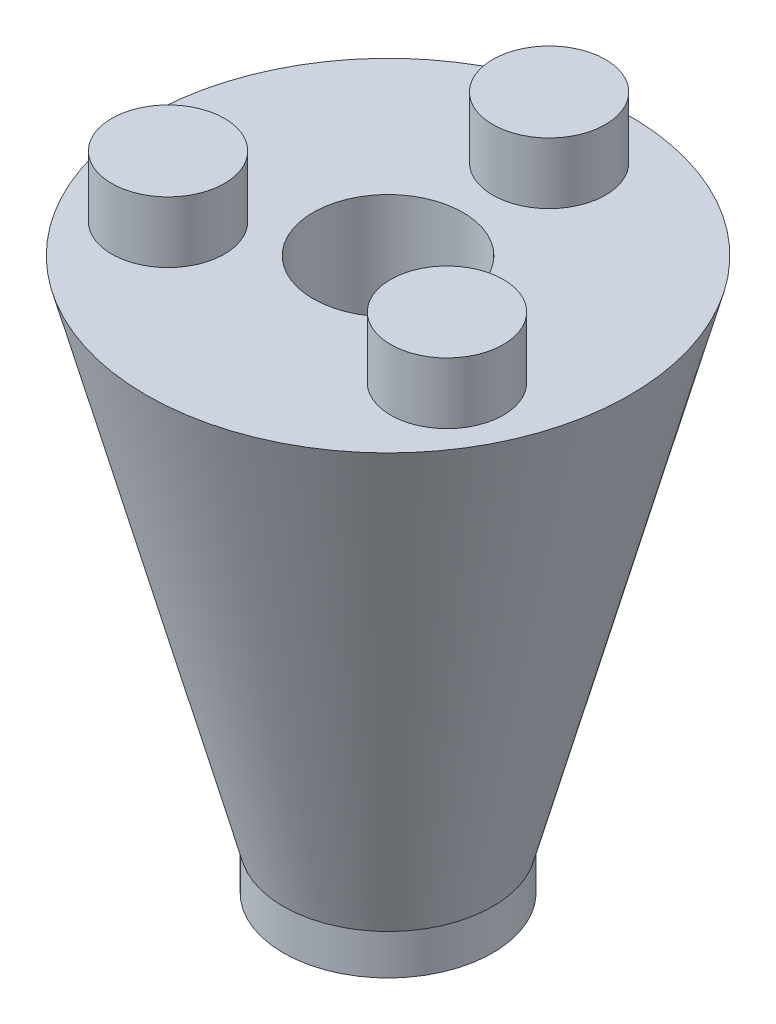
ISO-10303-21;
HEADER;
FILE_DESCRIPTION(('STEP AP214'),'2;1');
FILE_NAME('part.step','',(''),(''),'','','');
FILE_SCHEMA(('AUTOMOTIVE_DESIGN { 1 0 10303 214 1 1 1 1 }'));
ENDSEC;
DATA;
#1=APPLICATION_CONTEXT('core data for automotive mechanical design processes');
#2=APPLICATION_PROTOCOL_DEFINITION('international standard','automotive_design',2000,#1);
#3=PRODUCT_CONTEXT('',#1,'mechanical');
#4=PRODUCT('Part','Part','',(#3));
#5=PRODUCT_RELATED_PRODUCT_CATEGORY('part','',(#4));
#6=PRODUCT_DEFINITION_FORMATION('','',#4);
#7=PRODUCT_DEFINITION_CONTEXT('part definition',#1,'design');
#8=PRODUCT_DEFINITION('design','',#6,#7);
#9=PRODUCT_DEFINITION_SHAPE('','',#8);
#10=(LENGTH_UNIT() NAMED_UNIT(*) SI_UNIT(.MILLI.,.METRE.));
#11=(NAMED_UNIT(*) PLANE_ANGLE_UNIT() SI_UNIT($,.RADIAN.));
#12=(NAMED_UNIT(*) SI_UNIT($,.STERADIAN.) SOLID_ANGLE_UNIT());
#13=UNCERTAINTY_MEASURE_WITH_UNIT(LENGTH_MEASURE(1.E-05),#10,'distance_accuracy_value','');
#14=(GEOMETRIC_REPRESENTATION_CONTEXT(3) GLOBAL_UNCERTAINTY_ASSIGNED_CONTEXT((#13)) GLOBAL_UNIT_ASSIGNED_CONTEXT((#10,
#11,#12)) REPRESENTATION_CONTEXT('',''));
#15=CARTESIAN_POINT('',(0.,0.,0.));
#16=DIRECTION('',(0.,0.,1.));
#17=DIRECTION('',(1.,0.,0.));
#18=AXIS2_PLACEMENT_3D('',#15,#16,#17);
#19=CARTESIAN_POINT('',(0.,31.75,0.));
#20=DIRECTION('',(0.,1.,0.));
#21=DIRECTION('',(0.,0.,1.));
#22=AXIS2_PLACEMENT_3D('',#19,#20,#21);
#23=PLANE('',#22);
#24=CARTESIAN_POINT('',(-8.66025409500206,31.75,5.000000033));
#25=DIRECTION('',(0.,1.,0.));
#26=DIRECTION('',(0.,0.,1.));
#27=AXIS2_PLACEMENT_3D('',#24,#25,#26);
#28=CIRCLE('',#27,3.499999985);
#29=CARTESIAN_POINT('',(-8.66025409500206,31.75,1.500000048));
#30=VERTEX_POINT('',#29);
#31=EDGE_CURVE('E56',#30,#30,#28,.T.);
#32=ORIENTED_EDGE('',*,*,#31,.F.);
#33=EDGE_LOOP('',(#32));
#34=FACE_BOUND('',#33,.T.);
#35=CARTESIAN_POINT('',(0.,31.75,0.));
#36=DIRECTION('',(0.,1.,0.));
#37=DIRECTION('',(0.,0.,1.));
#38=AXIS2_PLACEMENT_3D('',#35,#36,#37);
#39=CIRCLE('',#38,15.0073869406882);
#40=CARTESIAN_POINT('',(0.,31.75,15.0073869406882));
#41=VERTEX_POINT('',#40);
#42=EDGE_CURVE('E10',#41,#41,#39,.T.);
#43=ORIENTED_EDGE('',*,*,#42,.T.);
#44=EDGE_LOOP('',(#43));
#45=FACE_BOUND('',#44,.T.);
#46=CARTESIAN_POINT('',(0.,31.75,0.));
#47=DIRECTION('',(0.,1.,0.));
#48=DIRECTION('',(0.,0.,1.));
#49=AXIS2_PLACEMENT_3D('',#46,#47,#48);
#50=CIRCLE('',#49,4.649999971);
#51=CARTESIAN_POINT('',(0.,31.75,4.649999971));
#52=VERTEX_POINT('',#51);
#53=EDGE_CURVE('E43',#52,#52,#50,.T.);
#54=ORIENTED_EDGE('',*,*,#53,.F.);
#55=EDGE_LOOP('',(#54));
#56=FACE_BOUND('',#55,.T.);
#57=CARTESIAN_POINT('',(0.,31.75,-10.000000066));
#58=DIRECTION('',(0.,1.,0.));
#59=DIRECTION('',(0.,0.,1.));
#60=AXIS2_PLACEMENT_3D('',#57,#58,#59);
#61=CIRCLE('',#60,3.499999985);
#62=CARTESIAN_POINT('',(0.,31.75,-13.500000051));
#63=VERTEX_POINT('',#62);
#64=EDGE_CURVE('E50',#63,#63,#61,.T.);
#65=ORIENTED_EDGE('',*,*,#64,.F.);
#66=EDGE_LOOP('',(#65));
#67=FACE_BOUND('',#66,.T.);
#68=CARTESIAN_POINT('',(8.66025409500207,31.75,5.000000033));
#69=DIRECTION('',(0.,1.,0.));
#70=DIRECTION('',(0.,0.,1.));
#71=AXIS2_PLACEMENT_3D('',#68,#69,#70);
#72=CIRCLE('',#71,3.499999985);
#73=CARTESIAN_POINT('',(8.66025409500207,31.75,1.500000048));
#74=VERTEX_POINT('',#73);
#75=EDGE_CURVE('E62',#74,#74,#72,.T.);
#76=ORIENTED_EDGE('',*,*,#75,.F.);
#77=EDGE_LOOP('',(#76));
#78=FACE_BOUND('',#77,.T.);
#79=ADVANCED_FACE('F32',(#34,#45,#56,#67,#78),#23,.T.);
#80=CARTESIAN_POINT('',(0.,0.,0.));
#81=DIRECTION('',(0.,1.,0.));
#82=DIRECTION('',(0.,0.,1.));
#83=AXIS2_PLACEMENT_3D('',#80,#81,#82);
#84=CONICAL_SURFACE('',#83,6.500000081,0.26179938779915);
#85=ORIENTED_EDGE('',*,*,#42,.F.);
#86=EDGE_LOOP('',(#85));
#87=FACE_BOUND('',#86,.T.);
#88=CARTESIAN_POINT('',(0.,0.,0.));
#89=DIRECTION('',(0.,-1.,0.));
#90=DIRECTION('',(0.,0.,-1.));
#91=AXIS2_PLACEMENT_3D('',#88,#89,#90);
#92=CIRCLE('',#91,6.500000081);
#93=CARTESIAN_POINT('',(0.,0.,-6.500000081));
#94=VERTEX_POINT('',#93);
#95=EDGE_CURVE('E68',#94,#94,#92,.T.);
#96=ORIENTED_EDGE('',*,*,#95,.F.);
#97=EDGE_LOOP('',(#96));
#98=FACE_BOUND('',#97,.T.);
#99=ADVANCED_FACE('F34',(#87,#98),#84,.T.);
#100=CARTESIAN_POINT('',(0.,0.,0.));
#101=DIRECTION('',(0.,1.,0.));
#102=DIRECTION('',(0.,0.,1.));
#103=AXIS2_PLACEMENT_3D('',#100,#101,#102);
#104=CYLINDRICAL_SURFACE('',#103,4.649999971);
#105=CARTESIAN_POINT('',(0.,0.,0.));
#106=DIRECTION('',(0.,1.,0.));
#107=DIRECTION('',(0.,0.,1.));
#108=AXIS2_PLACEMENT_3D('',#105,#106,#107);
#109=CIRCLE('',#108,4.649999971);
#110=CARTESIAN_POINT('',(0.,0.,4.649999971));
#111=VERTEX_POINT('',#110);
#112=EDGE_CURVE('E39',#111,#111,#109,.T.);
#113=ORIENTED_EDGE('',*,*,#112,.F.);
#114=EDGE_LOOP('',(#113));
#115=FACE_BOUND('',#114,.T.);
#116=ORIENTED_EDGE('',*,*,#53,.T.);
#117=EDGE_LOOP('',(#116));
#118=FACE_BOUND('',#117,.T.);
#119=ADVANCED_FACE('F104',(#115,#118),#104,.F.);
#120=CARTESIAN_POINT('',(0.,35.55000002,-10.000000066));
#121=DIRECTION('',(0.,-1.,0.));
#122=DIRECTION('',(0.,0.,-1.));
#123=AXIS2_PLACEMENT_3D('',#120,#121,#122);
#124=CYLINDRICAL_SURFACE('',#123,3.499999985);
#125=CARTESIAN_POINT('',(0.,35.55000002,-10.000000066));
#126=DIRECTION('',(0.,1.,0.));
#127=DIRECTION('',(0.,0.,1.));
#128=AXIS2_PLACEMENT_3D('',#125,#126,#127);
#129=CIRCLE('',#128,3.499999985);
#130=CARTESIAN_POINT('',(0.,35.55000002,-13.500000051));
#131=VERTEX_POINT('',#130);
#132=EDGE_CURVE('E48',#131,#131,#129,.T.);
#133=CARTESIAN_POINT('',(0.,35.55000002,-13.500000051));
#134=CARTESIAN_POINT('',(0.,35.5104166864583,-13.500000051));
#135=CARTESIAN_POINT('',(0.,35.4708333529167,-13.500000051));
#136=CARTESIAN_POINT('',(0.,35.3916666858333,-13.500000051));
#137=CARTESIAN_POINT('',(0.,35.3520833522917,-13.500000051));
#138=CARTESIAN_POINT('',(0.,35.2729166852083,-13.500000051));
#139=CARTESIAN_POINT('',(0.,35.2333333516667,-13.500000051));
#140=CARTESIAN_POINT('',(0.,35.1541666845833,-13.500000051));
#141=CARTESIAN_POINT('',(0.,35.1145833510417,-13.500000051));
#142=CARTESIAN_POINT('',(0.,35.0354166839583,-13.500000051));
#143=CARTESIAN_POINT('',(0.,34.9958333504167,-13.500000051));
#144=CARTESIAN_POINT('',(0.,34.9166666833333,-13.500000051));
#145=CARTESIAN_POINT('',(0.,34.8770833497917,-13.500000051));
#146=CARTESIAN_POINT('',(0.,34.7979166827083,-13.500000051));
#147=CARTESIAN_POINT('',(0.,34.7583333491667,-13.500000051));
#148=CARTESIAN_POINT('',(0.,34.6791666820833,-13.500000051));
#149=CARTESIAN_POINT('',(0.,34.6395833485417,-13.500000051));
#150=CARTESIAN_POINT('',(0.,34.5604166814583,-13.500000051));
#151=CARTESIAN_POINT('',(0.,34.5208333479167,-13.500000051));
#152=CARTESIAN_POINT('',(0.,34.4416666808333,-13.500000051));
#153=CARTESIAN_POINT('',(0.,34.4020833472917,-13.500000051));
#154=CARTESIAN_POINT('',(0.,34.3229166802083,-13.500000051));
#155=CARTESIAN_POINT('',(0.,34.2833333466667,-13.500000051));
#156=CARTESIAN_POINT('',(0.,34.2041666795833,-13.500000051));
#157=CARTESIAN_POINT('',(0.,34.1645833460417,-13.500000051));
#158=CARTESIAN_POINT('',(0.,34.0854166789583,-13.500000051));
#159=CARTESIAN_POINT('',(0.,34.0458333454167,-13.500000051));
#160=CARTESIAN_POINT('',(0.,33.9666666783333,-13.500000051));
#161=CARTESIAN_POINT('',(0.,33.9270833447917,-13.500000051));
#162=CARTESIAN_POINT('',(0.,33.8479166777083,-13.500000051));
#163=CARTESIAN_POINT('',(0.,33.8083333441667,-13.500000051));
#164=CARTESIAN_POINT('',(0.,33.7291666770833,-13.500000051));
#165=CARTESIAN_POINT('',(0.,33.6895833435417,-13.500000051));
#166=CARTESIAN_POINT('',(0.,33.6104166764583,-13.500000051));
#167=CARTESIAN_POINT('',(0.,33.5708333429167,-13.500000051));
#168=CARTESIAN_POINT('',(0.,33.4916666758333,-13.500000051));
#169=CARTESIAN_POINT('',(0.,33.4520833422917,-13.500000051));
#170=CARTESIAN_POINT('',(0.,33.3729166752083,-13.500000051));
#171=CARTESIAN_POINT('',(0.,33.3333333416667,-13.500000051));
#172=CARTESIAN_POINT('',(0.,33.2541666745833,-13.500000051));
#173=CARTESIAN_POINT('',(0.,33.2145833410417,-13.500000051));
#174=CARTESIAN_POINT('',(0.,33.1354166739583,-13.500000051));
#175=CARTESIAN_POINT('',(0.,33.0958333404167,-13.500000051));
#176=CARTESIAN_POINT('',(0.,33.0166666733333,-13.500000051));
#177=CARTESIAN_POINT('',(0.,32.9770833397917,-13.500000051));
#178=CARTESIAN_POINT('',(0.,32.8979166727083,-13.500000051));
#179=CARTESIAN_POINT('',(0.,32.8583333391667,-13.500000051));
#180=CARTESIAN_POINT('',(0.,32.7791666720833,-13.500000051));
#181=CARTESIAN_POINT('',(0.,32.7395833385417,-13.500000051));
#182=CARTESIAN_POINT('',(0.,32.6604166714583,-13.500000051));
#183=CARTESIAN_POINT('',(0.,32.6208333379167,-13.500000051));
#184=CARTESIAN_POINT('',(0.,32.5416666708333,-13.500000051));
#185=CARTESIAN_POINT('',(0.,32.5020833372917,-13.500000051));
#186=CARTESIAN_POINT('',(0.,32.4229166702083,-13.500000051));
#187=CARTESIAN_POINT('',(0.,32.3833333366667,-13.500000051));
#188=CARTESIAN_POINT('',(0.,32.3041666695833,-13.500000051));
#189=CARTESIAN_POINT('',(0.,32.2645833360417,-13.500000051));
#190=CARTESIAN_POINT('',(0.,32.1854166689583,-13.500000051));
#191=CARTESIAN_POINT('',(0.,32.1458333354167,-13.500000051));
#192=CARTESIAN_POINT('',(0.,32.0666666683333,-13.500000051));
#193=CARTESIAN_POINT('',(0.,32.0270833347917,-13.500000051));
#194=CARTESIAN_POINT('',(0.,31.9479166677083,-13.500000051));
#195=CARTESIAN_POINT('',(0.,31.9083333341667,-13.500000051));
#196=CARTESIAN_POINT('',(0.,31.8291666670833,-13.500000051));
#197=CARTESIAN_POINT('',(0.,31.7895833335417,-13.500000051));
#198=CARTESIAN_POINT('',(0.,31.75,-13.500000051));
#199=B_SPLINE_CURVE_WITH_KNOTS('',3,(#133,#134,#135,#136,#137,#138,#139,#140,#141,#142,#143,
#144,#145,#146,#147,#148,#149,#150,#151,#152,#153,#154,#155,#156,#157,#158,#159,#160,#161,#162,
#163,#164,#165,#166,#167,#168,#169,#170,#171,#172,#173,#174,#175,#176,#177,#178,#179,#180,#181,
#182,#183,#184,#185,#186,#187,#188,#189,#190,#191,#192,#193,#194,#195,#196,#197,#198),
.UNSPECIFIED.,.F.,.F.,(4,2,2,2,2,2,2,2,2,2,2,2,2,2,2,2,2,2,2,2,2,2,2,2,2,2,2,2,2,2,2,2,4),(0.,
0.118750000624994,0.237500001249995,0.356250001874996,0.475000002499996,0.593750003124997,
0.712500003749998,0.831250004374999,0.950000005,1.06875000562499,1.18750000624999,
1.306250006875,1.4250000075,1.543750008125,1.66250000875,1.781250009375,1.90000001,
2.01875001062499,2.13750001124999,2.256250011875,2.3750000125,2.493750013125,2.61250001375,
2.731250014375,2.850000015,2.96875001562499,3.08750001624999,3.206250016875,3.3250000175,
3.443750018125,3.56250001875,3.681250019375,3.80000002),.UNSPECIFIED.);
#200=EDGE_CURVE('BSEAM110',#131,#63,#199,.T.);
#201=ORIENTED_EDGE('',*,*,#132,.F.);
#202=ORIENTED_EDGE('',*,*,#64,.T.);
#203=ORIENTED_EDGE('',*,*,#200,.T.);
#204=ORIENTED_EDGE('',*,*,#200,.F.);
#205=EDGE_LOOP('',(#201,#203,#202,#204));
#206=FACE_BOUND('',#205,.T.);
#207=ADVANCED_FACE('F110',(#206),#124,.T.);
#208=CARTESIAN_POINT('',(0.,35.55000002,0.));
#209=DIRECTION('',(0.,1.,0.));
#210=DIRECTION('',(0.,0.,1.));
#211=AXIS2_PLACEMENT_3D('',#208,#209,#210);
#212=PLANE('',#211);
#213=ORIENTED_EDGE('',*,*,#132,.T.);
#214=EDGE_LOOP('',(#213));
#215=FACE_BOUND('',#214,.T.);
#216=ADVANCED_FACE('F114',(#215),#212,.T.);
#217=CARTESIAN_POINT('',(-8.66025409500206,35.55000002,5.000000033));
#218=DIRECTION('',(0.,-1.,0.));
#219=DIRECTION('',(0.,0.,-1.));
#220=AXIS2_PLACEMENT_3D('',#217,#218,#219);
#221=CYLINDRICAL_SURFACE('',#220,3.499999985);
#222=CARTESIAN_POINT('',(-8.66025409500206,35.55000002,5.000000033));
#223=DIRECTION('',(0.,1.,0.));
#224=DIRECTION('',(0.,0.,1.));
#225=AXIS2_PLACEMENT_3D('',#222,#223,#224);
#226=CIRCLE('',#225,3.499999985);
#227=CARTESIAN_POINT('',(-8.66025409500206,35.55000002,1.500000048));
#228=VERTEX_POINT('',#227);
#229=EDGE_CURVE('E53',#228,#228,#226,.T.);
#230=CARTESIAN_POINT('',(-8.66025409500206,35.55000002,1.500000048));
#231=CARTESIAN_POINT('',(-8.66025409500206,35.5104166864583,1.500000048));
#232=CARTESIAN_POINT('',(-8.66025409500206,35.4708333529167,1.500000048));
#233=CARTESIAN_POINT('',(-8.66025409500206,35.3916666858333,1.500000048));
#234=CARTESIAN_POINT('',(-8.66025409500206,35.3520833522917,1.500000048));
#235=CARTESIAN_POINT('',(-8.66025409500206,35.2729166852083,1.500000048));
#236=CARTESIAN_POINT('',(-8.66025409500206,35.2333333516667,1.500000048));
#237=CARTESIAN_POINT('',(-8.66025409500206,35.1541666845833,1.500000048));
#238=CARTESIAN_POINT('',(-8.66025409500206,35.1145833510417,1.500000048));
#239=CARTESIAN_POINT('',(-8.66025409500206,35.0354166839583,1.500000048));
#240=CARTESIAN_POINT('',(-8.66025409500206,34.9958333504167,1.500000048));
#241=CARTESIAN_POINT('',(-8.66025409500206,34.9166666833333,1.500000048));
#242=CARTESIAN_POINT('',(-8.66025409500206,34.8770833497917,1.500000048));
#243=CARTESIAN_POINT('',(-8.66025409500206,34.7979166827083,1.500000048));
#244=CARTESIAN_POINT('',(-8.66025409500206,34.7583333491667,1.500000048));
#245=CARTESIAN_POINT('',(-8.66025409500206,34.6791666820833,1.500000048));
#246=CARTESIAN_POINT('',(-8.66025409500206,34.6395833485417,1.500000048));
#247=CARTESIAN_POINT('',(-8.66025409500206,34.5604166814583,1.500000048));
#248=CARTESIAN_POINT('',(-8.66025409500206,34.5208333479167,1.500000048));
#249=CARTESIAN_POINT('',(-8.66025409500206,34.4416666808333,1.500000048));
#250=CARTESIAN_POINT('',(-8.66025409500206,34.4020833472917,1.500000048));
#251=CARTESIAN_POINT('',(-8.66025409500206,34.3229166802083,1.500000048));
#252=CARTESIAN_POINT('',(-8.66025409500206,34.2833333466667,1.500000048));
#253=CARTESIAN_POINT('',(-8.66025409500206,34.2041666795833,1.500000048));
#254=CARTESIAN_POINT('',(-8.66025409500206,34.1645833460417,1.500000048));
#255=CARTESIAN_POINT('',(-8.66025409500206,34.0854166789583,1.500000048));
#256=CARTESIAN_POINT('',(-8.66025409500206,34.0458333454167,1.500000048));
#257=CARTESIAN_POINT('',(-8.66025409500206,33.9666666783333,1.500000048));
#258=CARTESIAN_POINT('',(-8.66025409500206,33.9270833447917,1.500000048));
#259=CARTESIAN_POINT('',(-8.66025409500206,33.8479166777083,1.500000048));
#260=CARTESIAN_POINT('',(-8.66025409500206,33.8083333441667,1.500000048));
#261=CARTESIAN_POINT('',(-8.66025409500206,33.7291666770833,1.500000048));
#262=CARTESIAN_POINT('',(-8.66025409500206,33.6895833435417,1.500000048));
#263=CARTESIAN_POINT('',(-8.66025409500206,33.6104166764583,1.500000048));
#264=CARTESIAN_POINT('',(-8.66025409500206,33.5708333429167,1.500000048));
#265=CARTESIAN_POINT('',(-8.66025409500206,33.4916666758333,1.500000048));
#266=CARTESIAN_POINT('',(-8.66025409500206,33.4520833422917,1.500000048));
#267=CARTESIAN_POINT('',(-8.66025409500206,33.3729166752083,1.500000048));
#268=CARTESIAN_POINT('',(-8.66025409500206,33.3333333416667,1.500000048));
#269=CARTESIAN_POINT('',(-8.66025409500206,33.2541666745833,1.500000048));
#270=CARTESIAN_POINT('',(-8.66025409500206,33.2145833410417,1.500000048));
#271=CARTESIAN_POINT('',(-8.66025409500206,33.1354166739583,1.500000048));
#272=CARTESIAN_POINT('',(-8.66025409500206,33.0958333404167,1.500000048));
#273=CARTESIAN_POINT('',(-8.66025409500206,33.0166666733333,1.500000048));
#274=CARTESIAN_POINT('',(-8.66025409500206,32.9770833397917,1.500000048));
#275=CARTESIAN_POINT('',(-8.66025409500206,32.8979166727083,1.500000048));
#276=CARTESIAN_POINT('',(-8.66025409500206,32.8583333391667,1.500000048));
#277=CARTESIAN_POINT('',(-8.66025409500206,32.7791666720833,1.500000048));
#278=CARTESIAN_POINT('',(-8.66025409500206,32.7395833385417,1.500000048));
#279=CARTESIAN_POINT('',(-8.66025409500206,32.6604166714583,1.500000048));
#280=CARTESIAN_POINT('',(-8.66025409500206,32.6208333379167,1.500000048));
#281=CARTESIAN_POINT('',(-8.66025409500206,32.5416666708333,1.500000048));
#282=CARTESIAN_POINT('',(-8.66025409500206,32.5020833372917,1.500000048));
#283=CARTESIAN_POINT('',(-8.66025409500206,32.4229166702083,1.500000048));
#284=CARTESIAN_POINT('',(-8.66025409500206,32.3833333366667,1.500000048));
#285=CARTESIAN_POINT('',(-8.66025409500206,32.3041666695833,1.500000048));
#286=CARTESIAN_POINT('',(-8.66025409500206,32.2645833360417,1.500000048));
#287=CARTESIAN_POINT('',(-8.66025409500206,32.1854166689583,1.500000048));
#288=CARTESIAN_POINT('',(-8.66025409500206,32.1458333354167,1.500000048));
#289=CARTESIAN_POINT('',(-8.66025409500206,32.0666666683333,1.500000048));
#290=CARTESIAN_POINT('',(-8.66025409500206,32.0270833347917,1.500000048));
#291=CARTESIAN_POINT('',(-8.66025409500206,31.9479166677083,1.500000048));
#292=CARTESIAN_POINT('',(-8.66025409500206,31.9083333341667,1.500000048));
#293=CARTESIAN_POINT('',(-8.66025409500206,31.8291666670833,1.500000048));
#294=CARTESIAN_POINT('',(-8.66025409500206,31.7895833335417,1.500000048));
#295=CARTESIAN_POINT('',(-8.66025409500206,31.75,1.500000048));
#296=B_SPLINE_CURVE_WITH_KNOTS('',3,(#230,#231,#232,#233,#234,#235,#236,#237,#238,#239,#240,
#241,#242,#243,#244,#245,#246,#247,#248,#249,#250,#251,#252,#253,#254,#255,#256,#257,#258,#259,
#260,#261,#262,#263,#264,#265,#266,#267,#268,#269,#270,#271,#272,#273,#274,#275,#276,#277,#278,
#279,#280,#281,#282,#283,#284,#285,#286,#287,#288,#289,#290,#291,#292,#293,#294,#295),
.UNSPECIFIED.,.F.,.F.,(4,2,2,2,2,2,2,2,2,2,2,2,2,2,2,2,2,2,2,2,2,2,2,2,2,2,2,2,2,2,2,2,4),(0.,
0.118750000624994,0.237500001249995,0.356250001874996,0.475000002499996,0.593750003124997,
0.712500003749998,0.831250004374999,0.950000005,1.06875000562499,1.18750000624999,
1.306250006875,1.4250000075,1.543750008125,1.66250000875,1.781250009375,1.90000001,
2.01875001062499,2.13750001124999,2.256250011875,2.3750000125,2.493750013125,2.61250001375,
2.731250014375,2.850000015,2.96875001562499,3.08750001624999,3.206250016875,3.3250000175,
3.443750018125,3.56250001875,3.681250019375,3.80000002),.UNSPECIFIED.);
#297=EDGE_CURVE('BSEAM118',#228,#30,#296,.T.);
#298=ORIENTED_EDGE('',*,*,#229,.F.);
#299=ORIENTED_EDGE('',*,*,#31,.T.);
#300=ORIENTED_EDGE('',*,*,#297,.T.);
#301=ORIENTED_EDGE('',*,*,#297,.F.);
#302=EDGE_LOOP('',(#298,#300,#299,#301));
#303=FACE_BOUND('',#302,.T.);
#304=ADVANCED_FACE('F118',(#303),#221,.T.);
#305=CARTESIAN_POINT('',(0.,35.55000002,0.));
#306=DIRECTION('',(0.,1.,0.));
#307=DIRECTION('',(0.,0.,1.));
#308=AXIS2_PLACEMENT_3D('',#305,#306,#307);
#309=PLANE('',#308);
#310=ORIENTED_EDGE('',*,*,#229,.T.);
#311=EDGE_LOOP('',(#310));
#312=FACE_BOUND('',#311,.T.);
#313=ADVANCED_FACE('F122',(#312),#309,.T.);
#314=CARTESIAN_POINT('',(8.66025409500207,35.55000002,5.000000033));
#315=DIRECTION('',(0.,-1.,0.));
#316=DIRECTION('',(0.,0.,-1.));
#317=AXIS2_PLACEMENT_3D('',#314,#315,#316);
#318=CYLINDRICAL_SURFACE('',#317,3.499999985);
#319=CARTESIAN_POINT('',(8.66025409500207,35.55000002,5.000000033));
#320=DIRECTION('',(0.,1.,0.));
#321=DIRECTION('',(0.,0.,1.));
#322=AXIS2_PLACEMENT_3D('',#319,#320,#321);
#323=CIRCLE('',#322,3.499999985);
#324=CARTESIAN_POINT('',(8.66025409500207,35.55000002,1.500000048));
#325=VERTEX_POINT('',#324);
#326=EDGE_CURVE('E59',#325,#325,#323,.T.);
#327=CARTESIAN_POINT('',(8.66025409500207,35.55000002,1.500000048));
#328=CARTESIAN_POINT('',(8.66025409500207,35.5104166864583,1.500000048));
#329=CARTESIAN_POINT('',(8.66025409500207,35.4708333529167,1.500000048));
#330=CARTESIAN_POINT('',(8.66025409500207,35.3916666858333,1.500000048));
#331=CARTESIAN_POINT('',(8.66025409500207,35.3520833522917,1.500000048));
#332=CARTESIAN_POINT('',(8.66025409500207,35.2729166852083,1.500000048));
#333=CARTESIAN_POINT('',(8.66025409500207,35.2333333516667,1.500000048));
#334=CARTESIAN_POINT('',(8.66025409500207,35.1541666845833,1.500000048));
#335=CARTESIAN_POINT('',(8.66025409500207,35.1145833510417,1.500000048));
#336=CARTESIAN_POINT('',(8.66025409500207,35.0354166839583,1.500000048));
#337=CARTESIAN_POINT('',(8.66025409500207,34.9958333504167,1.500000048));
#338=CARTESIAN_POINT('',(8.66025409500207,34.9166666833333,1.500000048));
#339=CARTESIAN_POINT('',(8.66025409500207,34.8770833497917,1.500000048));
#340=CARTESIAN_POINT('',(8.66025409500207,34.7979166827083,1.500000048));
#341=CARTESIAN_POINT('',(8.66025409500207,34.7583333491667,1.500000048));
#342=CARTESIAN_POINT('',(8.66025409500207,34.6791666820833,1.500000048));
#343=CARTESIAN_POINT('',(8.66025409500207,34.6395833485417,1.500000048));
#344=CARTESIAN_POINT('',(8.66025409500207,34.5604166814583,1.500000048));
#345=CARTESIAN_POINT('',(8.66025409500207,34.5208333479167,1.500000048));
#346=CARTESIAN_POINT('',(8.66025409500207,34.4416666808333,1.500000048));
#347=CARTESIAN_POINT('',(8.66025409500207,34.4020833472917,1.500000048));
#348=CARTESIAN_POINT('',(8.66025409500207,34.3229166802083,1.500000048));
#349=CARTESIAN_POINT('',(8.66025409500207,34.2833333466667,1.500000048));
#350=CARTESIAN_POINT('',(8.66025409500207,34.2041666795833,1.500000048));
#351=CARTESIAN_POINT('',(8.66025409500207,34.1645833460417,1.500000048));
#352=CARTESIAN_POINT('',(8.66025409500207,34.0854166789583,1.500000048));
#353=CARTESIAN_POINT('',(8.66025409500207,34.0458333454167,1.500000048));
#354=CARTESIAN_POINT('',(8.66025409500207,33.9666666783333,1.500000048));
#355=CARTESIAN_POINT('',(8.66025409500207,33.9270833447917,1.500000048));
#356=CARTESIAN_POINT('',(8.66025409500207,33.8479166777083,1.500000048));
#357=CARTESIAN_POINT('',(8.66025409500207,33.8083333441667,1.500000048));
#358=CARTESIAN_POINT('',(8.66025409500207,33.7291666770833,1.500000048));
#359=CARTESIAN_POINT('',(8.66025409500207,33.6895833435417,1.500000048));
#360=CARTESIAN_POINT('',(8.66025409500207,33.6104166764583,1.500000048));
#361=CARTESIAN_POINT('',(8.66025409500207,33.5708333429167,1.500000048));
#362=CARTESIAN_POINT('',(8.66025409500207,33.4916666758333,1.500000048));
#363=CARTESIAN_POINT('',(8.66025409500207,33.4520833422917,1.500000048));
#364=CARTESIAN_POINT('',(8.66025409500207,33.3729166752083,1.500000048));
#365=CARTESIAN_POINT('',(8.66025409500207,33.3333333416667,1.500000048));
#366=CARTESIAN_POINT('',(8.66025409500207,33.2541666745833,1.500000048));
#367=CARTESIAN_POINT('',(8.66025409500207,33.2145833410417,1.500000048));
#368=CARTESIAN_POINT('',(8.66025409500207,33.1354166739583,1.500000048));
#369=CARTESIAN_POINT('',(8.66025409500207,33.0958333404167,1.500000048));
#370=CARTESIAN_POINT('',(8.66025409500207,33.0166666733333,1.500000048));
#371=CARTESIAN_POINT('',(8.66025409500207,32.9770833397917,1.500000048));
#372=CARTESIAN_POINT('',(8.66025409500207,32.8979166727083,1.500000048));
#373=CARTESIAN_POINT('',(8.66025409500207,32.8583333391667,1.500000048));
#374=CARTESIAN_POINT('',(8.66025409500207,32.7791666720833,1.500000048));
#375=CARTESIAN_POINT('',(8.66025409500207,32.7395833385417,1.500000048));
#376=CARTESIAN_POINT('',(8.66025409500207,32.6604166714583,1.500000048));
#377=CARTESIAN_POINT('',(8.66025409500207,32.6208333379167,1.500000048));
#378=CARTESIAN_POINT('',(8.66025409500207,32.5416666708333,1.500000048));
#379=CARTESIAN_POINT('',(8.66025409500207,32.5020833372917,1.500000048));
#380=CARTESIAN_POINT('',(8.66025409500207,32.4229166702083,1.500000048));
#381=CARTESIAN_POINT('',(8.66025409500207,32.3833333366667,1.500000048));
#382=CARTESIAN_POINT('',(8.66025409500207,32.3041666695833,1.500000048));
#383=CARTESIAN_POINT('',(8.66025409500207,32.2645833360417,1.500000048));
#384=CARTESIAN_POINT('',(8.66025409500207,32.1854166689583,1.500000048));
#385=CARTESIAN_POINT('',(8.66025409500207,32.1458333354167,1.500000048));
#386=CARTESIAN_POINT('',(8.66025409500207,32.0666666683333,1.500000048));
#387=CARTESIAN_POINT('',(8.66025409500207,32.0270833347917,1.500000048));
#388=CARTESIAN_POINT('',(8.66025409500207,31.9479166677083,1.500000048));
#389=CARTESIAN_POINT('',(8.66025409500207,31.9083333341667,1.500000048));
#390=CARTESIAN_POINT('',(8.66025409500207,31.8291666670833,1.500000048));
#391=CARTESIAN_POINT('',(8.66025409500207,31.7895833335417,1.500000048));
#392=CARTESIAN_POINT('',(8.66025409500207,31.75,1.500000048));
#393=B_SPLINE_CURVE_WITH_KNOTS('',3,(#327,#328,#329,#330,#331,#332,#333,#334,#335,#336,#337,
#338,#339,#340,#341,#342,#343,#344,#345,#346,#347,#348,#349,#350,#351,#352,#353,#354,#355,#356,
#357,#358,#359,#360,#361,#362,#363,#364,#365,#366,#367,#368,#369,#370,#371,#372,#373,#374,#375,
#376,#377,#378,#379,#380,#381,#382,#383,#384,#385,#386,#387,#388,#389,#390,#391,#392),
.UNSPECIFIED.,.F.,.F.,(4,2,2,2,2,2,2,2,2,2,2,2,2,2,2,2,2,2,2,2,2,2,2,2,2,2,2,2,2,2,2,2,4),(0.,
0.118750000624994,0.237500001249995,0.356250001874996,0.475000002499996,0.593750003124997,
0.712500003749998,0.831250004374999,0.950000005,1.06875000562499,1.18750000624999,
1.306250006875,1.4250000075,1.543750008125,1.66250000875,1.781250009375,1.90000001,
2.01875001062499,2.13750001124999,2.256250011875,2.3750000125,2.493750013125,2.61250001375,
2.731250014375,2.850000015,2.96875001562499,3.08750001624999,3.206250016875,3.3250000175,
3.443750018125,3.56250001875,3.681250019375,3.80000002),.UNSPECIFIED.);
#394=EDGE_CURVE('BSEAM126',#325,#74,#393,.T.);
#395=ORIENTED_EDGE('',*,*,#326,.F.);
#396=ORIENTED_EDGE('',*,*,#75,.T.);
#397=ORIENTED_EDGE('',*,*,#394,.T.);
#398=ORIENTED_EDGE('',*,*,#394,.F.);
#399=EDGE_LOOP('',(#395,#397,#396,#398));
#400=FACE_BOUND('',#399,.T.);
#401=ADVANCED_FACE('F126',(#400),#318,.T.);
#402=CARTESIAN_POINT('',(0.,35.55000002,0.));
#403=DIRECTION('',(0.,1.,0.));
#404=DIRECTION('',(0.,0.,1.));
#405=AXIS2_PLACEMENT_3D('',#402,#403,#404);
#406=PLANE('',#405);
#407=ORIENTED_EDGE('',*,*,#326,.T.);
#408=EDGE_LOOP('',(#407));
#409=FACE_BOUND('',#408,.T.);
#410=ADVANCED_FACE('F95',(#409),#406,.T.);
#411=CARTESIAN_POINT('',(0.,0.,0.));
#412=DIRECTION('',(0.,-1.,0.));
#413=DIRECTION('',(0.,0.,-1.));
#414=AXIS2_PLACEMENT_3D('',#411,#412,#413);
#415=PLANE('',#414);
#416=CARTESIAN_POINT('',(0.,0.,0.));
#417=DIRECTION('',(0.,-1.,0.));
#418=DIRECTION('',(0.,0.,-1.));
#419=AXIS2_PLACEMENT_3D('',#416,#417,#418);
#420=CIRCLE('',#419,3.300000004);
#421=CARTESIAN_POINT('',(0.,0.,-3.300000004));
#422=VERTEX_POINT('',#421);
#423=EDGE_CURVE('E74',#422,#422,#420,.T.);
#424=ORIENTED_EDGE('',*,*,#423,.T.);
#425=EDGE_LOOP('',(#424));
#426=FACE_BOUND('',#425,.T.);
#427=ORIENTED_EDGE('',*,*,#112,.T.);
#428=EDGE_LOOP('',(#427));
#429=FACE_BOUND('',#428,.T.);
#430=ADVANCED_FACE('F86',(#426,#429),#415,.F.);
#431=CARTESIAN_POINT('',(0.,-2.50000008,0.));
#432=DIRECTION('',(0.,-1.,0.));
#433=DIRECTION('',(0.,0.,-1.));
#434=AXIS2_PLACEMENT_3D('',#431,#432,#433);
#435=PLANE('',#434);
#436=CARTESIAN_POINT('',(0.,-2.50000008,0.));
#437=DIRECTION('',(0.,-1.,0.));
#438=DIRECTION('',(0.,0.,-1.));
#439=AXIS2_PLACEMENT_3D('',#436,#437,#438);
#440=CIRCLE('',#439,6.500000081);
#441=CARTESIAN_POINT('',(0.,-2.50000008,-6.500000081));
#442=VERTEX_POINT('',#441);
#443=EDGE_CURVE('E65',#442,#442,#440,.T.);
#444=ORIENTED_EDGE('',*,*,#443,.T.);
#445=EDGE_LOOP('',(#444));
#446=FACE_BOUND('',#445,.T.);
#447=CARTESIAN_POINT('',(0.,-2.50000008,0.));
#448=DIRECTION('',(0.,-1.,0.));
#449=DIRECTION('',(0.,0.,-1.));
#450=AXIS2_PLACEMENT_3D('',#447,#448,#449);
#451=CIRCLE('',#450,3.300000004);
#452=CARTESIAN_POINT('',(0.,-2.50000008,-3.300000004));
#453=VERTEX_POINT('',#452);
#454=EDGE_CURVE('E71',#453,#453,#451,.T.);
#455=ORIENTED_EDGE('',*,*,#454,.F.);
#456=EDGE_LOOP('',(#455));
#457=FACE_BOUND('',#456,.T.);
#458=ADVANCED_FACE('F83',(#446,#457),#435,.T.);
#459=CARTESIAN_POINT('',(0.,-2.50000008,0.));
#460=DIRECTION('',(0.,1.,0.));
#461=DIRECTION('',(0.,0.,1.));
#462=AXIS2_PLACEMENT_3D('',#459,#460,#461);
#463=CYLINDRICAL_SURFACE('',#462,6.500000081);
#464=ORIENTED_EDGE('',*,*,#443,.F.);
#465=EDGE_LOOP('',(#464));
#466=FACE_BOUND('',#465,.T.);
#467=ORIENTED_EDGE('',*,*,#95,.T.);
#468=EDGE_LOOP('',(#467));
#469=FACE_BOUND('',#468,.T.);
#470=ADVANCED_FACE('F85',(#466,#469),#463,.T.);
#471=CARTESIAN_POINT('',(0.,-2.50000008,0.));
#472=DIRECTION('',(0.,1.,0.));
#473=DIRECTION('',(0.,0.,1.));
#474=AXIS2_PLACEMENT_3D('',#471,#472,#473);
#475=CYLINDRICAL_SURFACE('',#474,3.300000004);
#476=ORIENTED_EDGE('',*,*,#454,.T.);
#477=EDGE_LOOP('',(#476));
#478=FACE_BOUND('',#477,.T.);
#479=ORIENTED_EDGE('',*,*,#423,.F.);
#480=EDGE_LOOP('',(#479));
#481=FACE_BOUND('',#480,.T.);
#482=ADVANCED_FACE('F80',(#478,#481),#475,.F.);
#483=CLOSED_SHELL('',(#79,#99,#119,#207,#216,#304,#313,#401,#410,#430,#458,#470,#482));
#484=MANIFOLD_SOLID_BREP('B2',#483);
#485=ADVANCED_BREP_SHAPE_REPRESENTATION('',(#18,#484),#14);
#486=SHAPE_DEFINITION_REPRESENTATION(#9,#485);
ENDSEC;
END-ISO-10303-21;
